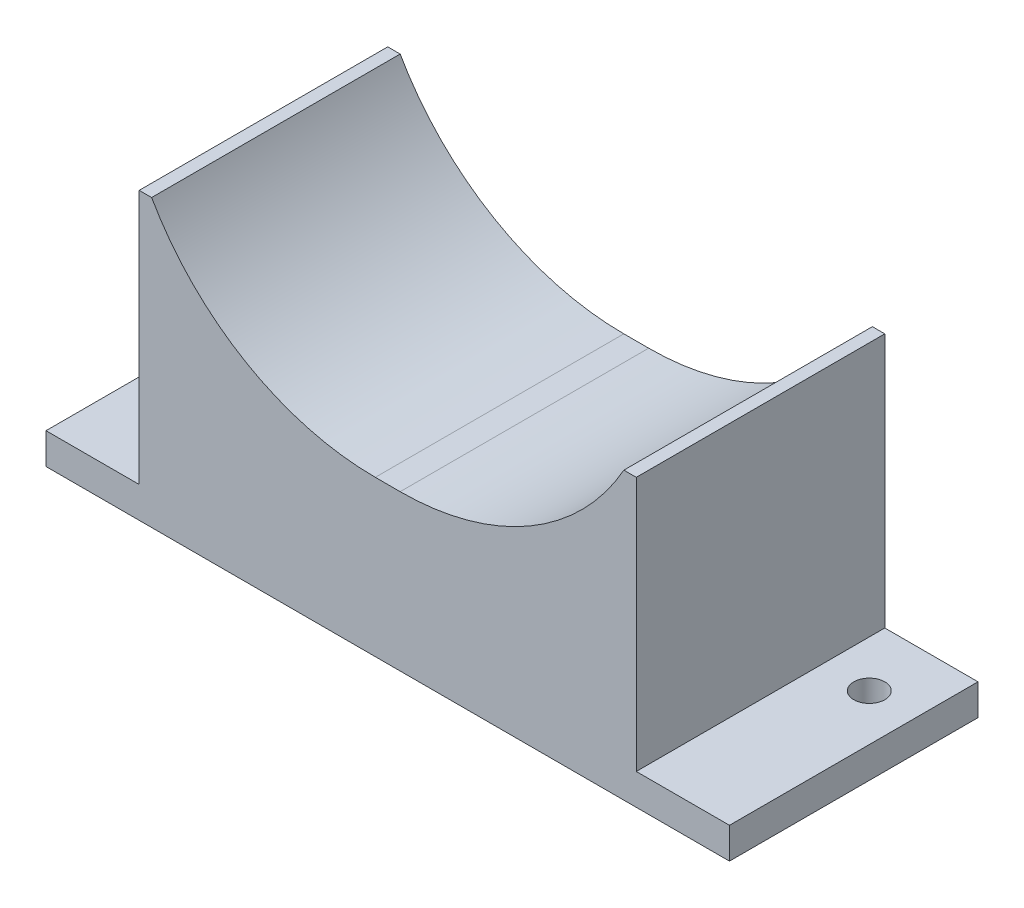
ISO-10303-21;
HEADER;
FILE_DESCRIPTION(('STEP AP214'),'2;1');
FILE_NAME('part.step','',(''),(''),'','','');
FILE_SCHEMA(('AUTOMOTIVE_DESIGN { 1 0 10303 214 1 1 1 1 }'));
ENDSEC;
DATA;
#1=APPLICATION_CONTEXT('core data for automotive mechanical design processes');
#2=APPLICATION_PROTOCOL_DEFINITION('international standard','automotive_design',2000,#1);
#3=PRODUCT_CONTEXT('',#1,'mechanical');
#4=PRODUCT('Part','Part','',(#3));
#5=PRODUCT_RELATED_PRODUCT_CATEGORY('part','',(#4));
#6=PRODUCT_DEFINITION_FORMATION('','',#4);
#7=PRODUCT_DEFINITION_CONTEXT('part definition',#1,'design');
#8=PRODUCT_DEFINITION('design','',#6,#7);
#9=PRODUCT_DEFINITION_SHAPE('','',#8);
#10=(LENGTH_UNIT() NAMED_UNIT(*) SI_UNIT(.MILLI.,.METRE.));
#11=(NAMED_UNIT(*) PLANE_ANGLE_UNIT() SI_UNIT($,.RADIAN.));
#12=(NAMED_UNIT(*) SI_UNIT($,.STERADIAN.) SOLID_ANGLE_UNIT());
#13=UNCERTAINTY_MEASURE_WITH_UNIT(LENGTH_MEASURE(1.E-05),#10,'distance_accuracy_value','');
#14=(GEOMETRIC_REPRESENTATION_CONTEXT(3) GLOBAL_UNCERTAINTY_ASSIGNED_CONTEXT((#13)) GLOBAL_UNIT_ASSIGNED_CONTEXT((#10,
#11,#12)) REPRESENTATION_CONTEXT('',''));
#15=CARTESIAN_POINT('',(0.,0.,0.));
#16=DIRECTION('',(0.,0.,1.));
#17=DIRECTION('',(1.,0.,0.));
#18=AXIS2_PLACEMENT_3D('',#15,#16,#17);
#19=CARTESIAN_POINT('',(-40.,4.99999999999999,40.));
#20=DIRECTION('',(1.,0.,0.));
#21=DIRECTION('',(0.,0.,-1.));
#22=AXIS2_PLACEMENT_3D('',#19,#20,#21);
#23=PLANE('',#22);
#24=DIRECTION('',(0.,-1.,0.));
#25=VECTOR('',#24,1.);
#26=CARTESIAN_POINT('',(-40.,4.99999999999999,0.));
#27=LINE('',#26,#25);
#28=CARTESIAN_POINT('',(-40.,46.,0.));
#29=VERTEX_POINT('',#28);
#30=CARTESIAN_POINT('',(-40.,4.99999999999999,0.));
#31=VERTEX_POINT('',#30);
#32=EDGE_CURVE('E165',#29,#31,#27,.T.);
#33=ORIENTED_EDGE('',*,*,#32,.T.);
#34=DIRECTION('',(0.,0.,-1.));
#35=VECTOR('',#34,1.);
#36=CARTESIAN_POINT('',(-40.,4.99999999999999,40.));
#37=LINE('',#36,#35);
#38=CARTESIAN_POINT('',(-40.,4.99999999999999,40.));
#39=VERTEX_POINT('',#38);
#40=EDGE_CURVE('E11',#39,#31,#37,.T.);
#41=ORIENTED_EDGE('',*,*,#40,.F.);
#42=DIRECTION('',(0.,-1.,0.));
#43=VECTOR('',#42,1.);
#44=CARTESIAN_POINT('',(-40.,4.99999999999999,40.));
#45=LINE('',#44,#43);
#46=CARTESIAN_POINT('',(-40.,46.,40.));
#47=VERTEX_POINT('',#46);
#48=EDGE_CURVE('E199',#47,#39,#45,.T.);
#49=ORIENTED_EDGE('',*,*,#48,.F.);
#50=DIRECTION('',(0.,0.,-1.));
#51=VECTOR('',#50,1.);
#52=CARTESIAN_POINT('',(-40.,46.,40.));
#53=LINE('',#52,#51);
#54=EDGE_CURVE('E161',#47,#29,#53,.T.);
#55=ORIENTED_EDGE('',*,*,#54,.T.);
#56=EDGE_LOOP('',(#33,#41,#49,#55));
#57=FACE_BOUND('',#56,.T.);
#58=ADVANCED_FACE('F39',(#57),#23,.F.);
#59=CARTESIAN_POINT('',(-55.,4.99999999999999,40.));
#60=DIRECTION('',(0.,-1.,0.));
#61=DIRECTION('',(0.,0.,-1.));
#62=AXIS2_PLACEMENT_3D('',#59,#60,#61);
#63=PLANE('',#62);
#64=CARTESIAN_POINT('',(-47.5,4.99999999999997,10.));
#65=DIRECTION('',(0.,1.,0.));
#66=DIRECTION('',(-1.,0.,0.));
#67=AXIS2_PLACEMENT_3D('',#64,#65,#66);
#68=CIRCLE('',#67,2.5);
#69=CARTESIAN_POINT('',(-50.,4.99999999999997,10.));
#70=VERTEX_POINT('',#69);
#71=EDGE_CURVE('E394',#70,#70,#68,.T.);
#72=ORIENTED_EDGE('',*,*,#71,.F.);
#73=EDGE_LOOP('',(#72));
#74=FACE_BOUND('',#73,.T.);
#75=DIRECTION('',(-1.,0.,0.));
#76=VECTOR('',#75,1.);
#77=CARTESIAN_POINT('',(-55.,4.99999999999999,0.));
#78=LINE('',#77,#76);
#79=CARTESIAN_POINT('',(-55.,4.99999999999999,0.));
#80=VERTEX_POINT('',#79);
#81=EDGE_CURVE('E169',#31,#80,#78,.T.);
#82=ORIENTED_EDGE('',*,*,#81,.T.);
#83=DIRECTION('',(0.,0.,-1.));
#84=VECTOR('',#83,1.);
#85=CARTESIAN_POINT('',(-55.,4.99999999999999,40.));
#86=LINE('',#85,#84);
#87=CARTESIAN_POINT('',(-55.,4.99999999999999,40.));
#88=VERTEX_POINT('',#87);
#89=EDGE_CURVE('E49',#88,#80,#86,.T.);
#90=ORIENTED_EDGE('',*,*,#89,.F.);
#91=DIRECTION('',(-1.,0.,0.));
#92=VECTOR('',#91,1.);
#93=CARTESIAN_POINT('',(-55.,4.99999999999999,40.));
#94=LINE('',#93,#92);
#95=EDGE_CURVE('E112',#39,#88,#94,.T.);
#96=ORIENTED_EDGE('',*,*,#95,.F.);
#97=ORIENTED_EDGE('',*,*,#40,.T.);
#98=EDGE_LOOP('',(#82,#90,#96,#97));
#99=FACE_BOUND('',#98,.T.);
#100=ADVANCED_FACE('F294',(#74,#99),#63,.F.);
#101=CARTESIAN_POINT('',(-55.,0.,40.));
#102=DIRECTION('',(1.,0.,0.));
#103=DIRECTION('',(0.,0.,-1.));
#104=AXIS2_PLACEMENT_3D('',#101,#102,#103);
#105=PLANE('',#104);
#106=DIRECTION('',(0.,-1.,0.));
#107=VECTOR('',#106,1.);
#108=CARTESIAN_POINT('',(-55.,0.,0.));
#109=LINE('',#108,#107);
#110=CARTESIAN_POINT('',(-55.,0.,0.));
#111=VERTEX_POINT('',#110);
#112=EDGE_CURVE('E172',#80,#111,#109,.T.);
#113=ORIENTED_EDGE('',*,*,#112,.T.);
#114=DIRECTION('',(0.,0.,-1.));
#115=VECTOR('',#114,1.);
#116=CARTESIAN_POINT('',(-55.,0.,40.));
#117=LINE('',#116,#115);
#118=CARTESIAN_POINT('',(-55.,0.,40.));
#119=VERTEX_POINT('',#118);
#120=EDGE_CURVE('E226',#119,#111,#117,.T.);
#121=ORIENTED_EDGE('',*,*,#120,.F.);
#122=DIRECTION('',(0.,-1.,0.));
#123=VECTOR('',#122,1.);
#124=CARTESIAN_POINT('',(-55.,0.,40.));
#125=LINE('',#124,#123);
#126=EDGE_CURVE('E237',#88,#119,#125,.T.);
#127=ORIENTED_EDGE('',*,*,#126,.F.);
#128=ORIENTED_EDGE('',*,*,#89,.T.);
#129=EDGE_LOOP('',(#113,#121,#127,#128));
#130=FACE_BOUND('',#129,.T.);
#131=ADVANCED_FACE('F235',(#130),#105,.F.);
#132=CARTESIAN_POINT('',(55.,0.,40.));
#133=DIRECTION('',(0.,1.,0.));
#134=DIRECTION('',(-1.,0.,0.));
#135=AXIS2_PLACEMENT_3D('',#132,#133,#134);
#136=PLANE('',#135);
#137=CARTESIAN_POINT('',(-47.5,0.,10.));
#138=DIRECTION('',(0.,1.,0.));
#139=DIRECTION('',(-1.,0.,0.));
#140=AXIS2_PLACEMENT_3D('',#137,#138,#139);
#141=CIRCLE('',#140,2.5);
#142=CARTESIAN_POINT('',(-50.,0.,10.));
#143=VERTEX_POINT('',#142);
#144=EDGE_CURVE('E42',#143,#143,#141,.T.);
#145=ORIENTED_EDGE('',*,*,#144,.T.);
#146=EDGE_LOOP('',(#145));
#147=FACE_BOUND('',#146,.T.);
#148=CARTESIAN_POINT('',(47.5,0.,9.99999999999999));
#149=DIRECTION('',(0.,1.,0.));
#150=DIRECTION('',(-1.,0.,0.));
#151=AXIS2_PLACEMENT_3D('',#148,#149,#150);
#152=CIRCLE('',#151,2.5);
#153=CARTESIAN_POINT('',(45.,0.,9.99999999999999));
#154=VERTEX_POINT('',#153);
#155=EDGE_CURVE('E398',#154,#154,#152,.T.);
#156=ORIENTED_EDGE('',*,*,#155,.T.);
#157=EDGE_LOOP('',(#156));
#158=FACE_BOUND('',#157,.T.);
#159=DIRECTION('',(1.,0.,0.));
#160=VECTOR('',#159,1.);
#161=CARTESIAN_POINT('',(55.,0.,0.));
#162=LINE('',#161,#160);
#163=CARTESIAN_POINT('',(55.,0.,0.));
#164=VERTEX_POINT('',#163);
#165=EDGE_CURVE('E175',#111,#164,#162,.T.);
#166=ORIENTED_EDGE('',*,*,#165,.T.);
#167=DIRECTION('',(0.,0.,-1.));
#168=VECTOR('',#167,1.);
#169=CARTESIAN_POINT('',(55.,0.,40.));
#170=LINE('',#169,#168);
#171=CARTESIAN_POINT('',(55.,0.,40.));
#172=VERTEX_POINT('',#171);
#173=EDGE_CURVE('E222',#172,#164,#170,.T.);
#174=ORIENTED_EDGE('',*,*,#173,.F.);
#175=DIRECTION('',(1.,0.,0.));
#176=VECTOR('',#175,1.);
#177=CARTESIAN_POINT('',(55.,0.,40.));
#178=LINE('',#177,#176);
#179=EDGE_CURVE('E256',#119,#172,#178,.T.);
#180=ORIENTED_EDGE('',*,*,#179,.F.);
#181=ORIENTED_EDGE('',*,*,#120,.T.);
#182=EDGE_LOOP('',(#166,#174,#180,#181));
#183=FACE_BOUND('',#182,.T.);
#184=ADVANCED_FACE('F246',(#147,#158,#183),#136,.F.);
#185=CARTESIAN_POINT('',(55.,0.,40.));
#186=DIRECTION('',(-1.,0.,0.));
#187=DIRECTION('',(0.,0.,1.));
#188=AXIS2_PLACEMENT_3D('',#185,#186,#187);
#189=PLANE('',#188);
#190=DIRECTION('',(0.,1.,0.));
#191=VECTOR('',#190,1.);
#192=CARTESIAN_POINT('',(55.,0.,0.));
#193=LINE('',#192,#191);
#194=CARTESIAN_POINT('',(55.,5.,0.));
#195=VERTEX_POINT('',#194);
#196=EDGE_CURVE('E178',#164,#195,#193,.T.);
#197=ORIENTED_EDGE('',*,*,#196,.T.);
#198=DIRECTION('',(0.,0.,-1.));
#199=VECTOR('',#198,1.);
#200=CARTESIAN_POINT('',(55.,5.,40.));
#201=LINE('',#200,#199);
#202=CARTESIAN_POINT('',(55.,5.,40.));
#203=VERTEX_POINT('',#202);
#204=EDGE_CURVE('E218',#203,#195,#201,.T.);
#205=ORIENTED_EDGE('',*,*,#204,.F.);
#206=DIRECTION('',(0.,1.,0.));
#207=VECTOR('',#206,1.);
#208=CARTESIAN_POINT('',(55.,0.,40.));
#209=LINE('',#208,#207);
#210=EDGE_CURVE('E252',#172,#203,#209,.T.);
#211=ORIENTED_EDGE('',*,*,#210,.F.);
#212=ORIENTED_EDGE('',*,*,#173,.T.);
#213=EDGE_LOOP('',(#197,#205,#211,#212));
#214=FACE_BOUND('',#213,.T.);
#215=ADVANCED_FACE('F250',(#214),#189,.F.);
#216=CARTESIAN_POINT('',(55.,5.,40.));
#217=DIRECTION('',(0.,-1.,0.));
#218=DIRECTION('',(1.,0.,0.));
#219=AXIS2_PLACEMENT_3D('',#216,#217,#218);
#220=PLANE('',#219);
#221=CARTESIAN_POINT('',(47.5,5.,9.99999999999999));
#222=DIRECTION('',(0.,1.,0.));
#223=DIRECTION('',(1.,0.,0.));
#224=AXIS2_PLACEMENT_3D('',#221,#222,#223);
#225=CIRCLE('',#224,2.5);
#226=CARTESIAN_POINT('',(50.,5.,9.99999999999999));
#227=VERTEX_POINT('',#226);
#228=EDGE_CURVE('E405',#227,#227,#225,.T.);
#229=ORIENTED_EDGE('',*,*,#228,.F.);
#230=EDGE_LOOP('',(#229));
#231=FACE_BOUND('',#230,.T.);
#232=DIRECTION('',(-1.,0.,0.));
#233=VECTOR('',#232,1.);
#234=CARTESIAN_POINT('',(55.,5.,0.));
#235=LINE('',#234,#233);
#236=CARTESIAN_POINT('',(40.,5.,0.));
#237=VERTEX_POINT('',#236);
#238=EDGE_CURVE('E181',#195,#237,#235,.T.);
#239=ORIENTED_EDGE('',*,*,#238,.T.);
#240=DIRECTION('',(0.,0.,-1.));
#241=VECTOR('',#240,1.);
#242=CARTESIAN_POINT('',(40.,5.,40.));
#243=LINE('',#242,#241);
#244=CARTESIAN_POINT('',(40.,5.,40.));
#245=VERTEX_POINT('',#244);
#246=EDGE_CURVE('E214',#245,#237,#243,.T.);
#247=ORIENTED_EDGE('',*,*,#246,.F.);
#248=DIRECTION('',(-1.,0.,0.));
#249=VECTOR('',#248,1.);
#250=CARTESIAN_POINT('',(55.,5.,40.));
#251=LINE('',#250,#249);
#252=EDGE_CURVE('E255',#203,#245,#251,.T.);
#253=ORIENTED_EDGE('',*,*,#252,.F.);
#254=ORIENTED_EDGE('',*,*,#204,.T.);
#255=EDGE_LOOP('',(#239,#247,#253,#254));
#256=FACE_BOUND('',#255,.T.);
#257=ADVANCED_FACE('F310',(#231,#256),#220,.F.);
#258=CARTESIAN_POINT('',(40.,5.,40.));
#259=DIRECTION('',(-1.,0.,0.));
#260=DIRECTION('',(0.,-1.,0.));
#261=AXIS2_PLACEMENT_3D('',#258,#259,#260);
#262=PLANE('',#261);
#263=DIRECTION('',(0.,1.,0.));
#264=VECTOR('',#263,1.);
#265=CARTESIAN_POINT('',(40.,5.,0.));
#266=LINE('',#265,#264);
#267=CARTESIAN_POINT('',(40.,46.,0.));
#268=VERTEX_POINT('',#267);
#269=EDGE_CURVE('E184',#237,#268,#266,.T.);
#270=ORIENTED_EDGE('',*,*,#269,.T.);
#271=DIRECTION('',(0.,0.,-1.));
#272=VECTOR('',#271,1.);
#273=CARTESIAN_POINT('',(40.,46.,40.));
#274=LINE('',#273,#272);
#275=CARTESIAN_POINT('',(40.,46.,40.));
#276=VERTEX_POINT('',#275);
#277=EDGE_CURVE('E210',#276,#268,#274,.T.);
#278=ORIENTED_EDGE('',*,*,#277,.F.);
#279=DIRECTION('',(0.,1.,0.));
#280=VECTOR('',#279,1.);
#281=CARTESIAN_POINT('',(40.,5.,40.));
#282=LINE('',#281,#280);
#283=EDGE_CURVE('E260',#245,#276,#282,.T.);
#284=ORIENTED_EDGE('',*,*,#283,.F.);
#285=ORIENTED_EDGE('',*,*,#246,.T.);
#286=EDGE_LOOP('',(#270,#278,#284,#285));
#287=FACE_BOUND('',#286,.T.);
#288=ADVANCED_FACE('F313',(#287),#262,.F.);
#289=CARTESIAN_POINT('',(40.,46.,40.));
#290=DIRECTION('',(0.,-1.,0.));
#291=DIRECTION('',(1.,0.,0.));
#292=AXIS2_PLACEMENT_3D('',#289,#290,#291);
#293=PLANE('',#292);
#294=DIRECTION('',(-1.,0.,0.));
#295=VECTOR('',#294,1.);
#296=CARTESIAN_POINT('',(40.,46.,0.));
#297=LINE('',#296,#295);
#298=CARTESIAN_POINT('',(38.,46.,0.));
#299=VERTEX_POINT('',#298);
#300=EDGE_CURVE('E187',#268,#299,#297,.T.);
#301=ORIENTED_EDGE('',*,*,#300,.T.);
#302=DIRECTION('',(0.,0.,-1.));
#303=VECTOR('',#302,1.);
#304=CARTESIAN_POINT('',(38.,46.,40.));
#305=LINE('',#304,#303);
#306=CARTESIAN_POINT('',(38.,46.,40.));
#307=VERTEX_POINT('',#306);
#308=EDGE_CURVE('E206',#307,#299,#305,.T.);
#309=ORIENTED_EDGE('',*,*,#308,.F.);
#310=DIRECTION('',(-1.,0.,0.));
#311=VECTOR('',#310,1.);
#312=CARTESIAN_POINT('',(40.,46.,40.));
#313=LINE('',#312,#311);
#314=EDGE_CURVE('E267',#276,#307,#313,.T.);
#315=ORIENTED_EDGE('',*,*,#314,.F.);
#316=ORIENTED_EDGE('',*,*,#277,.T.);
#317=EDGE_LOOP('',(#301,#309,#315,#316));
#318=FACE_BOUND('',#317,.T.);
#319=ADVANCED_FACE('F275',(#318),#293,.F.);
#320=CARTESIAN_POINT('',(1.99999999999999,66.3571428571429,40.));
#321=DIRECTION('',(0.,0.,-1.));
#322=DIRECTION('',(-1.,0.,0.));
#323=AXIS2_PLACEMENT_3D('',#320,#321,#322);
#324=CYLINDRICAL_SURFACE('',#323,41.3571428571429);
#325=CARTESIAN_POINT('',(1.99999999999999,66.3571428571429,0.));
#326=DIRECTION('',(0.,0.,-1.));
#327=DIRECTION('',(1.,0.,0.));
#328=AXIS2_PLACEMENT_3D('',#325,#326,#327);
#329=CIRCLE('',#328,41.3571428571429);
#330=CARTESIAN_POINT('',(1.99999999999998,25.,0.));
#331=VERTEX_POINT('',#330);
#332=EDGE_CURVE('E190',#299,#331,#329,.T.);
#333=ORIENTED_EDGE('',*,*,#332,.T.);
#334=DIRECTION('',(0.,0.,-1.));
#335=VECTOR('',#334,1.);
#336=CARTESIAN_POINT('',(1.99999999999998,25.,40.));
#337=LINE('',#336,#335);
#338=CARTESIAN_POINT('',(1.99999999999998,25.,40.));
#339=VERTEX_POINT('',#338);
#340=EDGE_CURVE('E154',#339,#331,#337,.T.);
#341=ORIENTED_EDGE('',*,*,#340,.F.);
#342=CARTESIAN_POINT('',(1.99999999999999,66.3571428571429,40.));
#343=DIRECTION('',(0.,0.,-1.));
#344=DIRECTION('',(1.,0.,0.));
#345=AXIS2_PLACEMENT_3D('',#342,#343,#344);
#346=CIRCLE('',#345,41.3571428571429);
#347=EDGE_CURVE('E143',#307,#339,#346,.T.);
#348=ORIENTED_EDGE('',*,*,#347,.F.);
#349=ORIENTED_EDGE('',*,*,#308,.T.);
#350=EDGE_LOOP('',(#333,#341,#348,#349));
#351=FACE_BOUND('',#350,.T.);
#352=ADVANCED_FACE('F279',(#351),#324,.F.);
#353=CARTESIAN_POINT('',(2.,25.,40.));
#354=DIRECTION('',(0.,-1.,0.));
#355=DIRECTION('',(1.,0.,0.));
#356=AXIS2_PLACEMENT_3D('',#353,#354,#355);
#357=PLANE('',#356);
#358=DIRECTION('',(-1.,0.,0.));
#359=VECTOR('',#358,1.);
#360=CARTESIAN_POINT('',(2.,25.,0.));
#361=LINE('',#360,#359);
#362=CARTESIAN_POINT('',(-2.,25.,0.));
#363=VERTEX_POINT('',#362);
#364=EDGE_CURVE('E152',#331,#363,#361,.T.);
#365=ORIENTED_EDGE('',*,*,#364,.T.);
#366=DIRECTION('',(0.,0.,-1.));
#367=VECTOR('',#366,1.);
#368=CARTESIAN_POINT('',(-2.,25.,40.));
#369=LINE('',#368,#367);
#370=CARTESIAN_POINT('',(-2.,25.,40.));
#371=VERTEX_POINT('',#370);
#372=EDGE_CURVE('E149',#371,#363,#369,.T.);
#373=ORIENTED_EDGE('',*,*,#372,.F.);
#374=DIRECTION('',(-1.,0.,0.));
#375=VECTOR('',#374,1.);
#376=CARTESIAN_POINT('',(2.,25.,40.));
#377=LINE('',#376,#375);
#378=EDGE_CURVE('E137',#339,#371,#377,.T.);
#379=ORIENTED_EDGE('',*,*,#378,.F.);
#380=ORIENTED_EDGE('',*,*,#340,.T.);
#381=EDGE_LOOP('',(#365,#373,#379,#380));
#382=FACE_BOUND('',#381,.T.);
#383=ADVANCED_FACE('F150',(#382),#357,.F.);
#384=CARTESIAN_POINT('',(-2.,66.3571428571429,40.));
#385=DIRECTION('',(0.,0.,-1.));
#386=DIRECTION('',(-1.,0.,0.));
#387=AXIS2_PLACEMENT_3D('',#384,#385,#386);
#388=CYLINDRICAL_SURFACE('',#387,41.3571428571429);
#389=CARTESIAN_POINT('',(-2.,66.3571428571429,0.));
#390=DIRECTION('',(0.,0.,-1.));
#391=DIRECTION('',(-1.,0.,0.));
#392=AXIS2_PLACEMENT_3D('',#389,#390,#391);
#393=CIRCLE('',#392,41.3571428571429);
#394=CARTESIAN_POINT('',(-38.,46.,0.));
#395=VERTEX_POINT('',#394);
#396=EDGE_CURVE('E98',#363,#395,#393,.T.);
#397=ORIENTED_EDGE('',*,*,#396,.T.);
#398=DIRECTION('',(0.,0.,-1.));
#399=VECTOR('',#398,1.);
#400=CARTESIAN_POINT('',(-38.,46.,40.));
#401=LINE('',#400,#399);
#402=CARTESIAN_POINT('',(-38.,46.,40.));
#403=VERTEX_POINT('',#402);
#404=EDGE_CURVE('E155',#403,#395,#401,.T.);
#405=ORIENTED_EDGE('',*,*,#404,.F.);
#406=CARTESIAN_POINT('',(-2.,66.3571428571429,40.));
#407=DIRECTION('',(0.,0.,-1.));
#408=DIRECTION('',(-1.,0.,0.));
#409=AXIS2_PLACEMENT_3D('',#406,#407,#408);
#410=CIRCLE('',#409,41.3571428571429);
#411=EDGE_CURVE('E141',#371,#403,#410,.T.);
#412=ORIENTED_EDGE('',*,*,#411,.F.);
#413=ORIENTED_EDGE('',*,*,#372,.T.);
#414=EDGE_LOOP('',(#397,#405,#412,#413));
#415=FACE_BOUND('',#414,.T.);
#416=ADVANCED_FACE('F157',(#415),#388,.F.);
#417=CARTESIAN_POINT('',(-40.,46.,40.));
#418=DIRECTION('',(0.,-1.,0.));
#419=DIRECTION('',(1.,0.,0.));
#420=AXIS2_PLACEMENT_3D('',#417,#418,#419);
#421=PLANE('',#420);
#422=DIRECTION('',(-1.,0.,0.));
#423=VECTOR('',#422,1.);
#424=CARTESIAN_POINT('',(-40.,46.,0.));
#425=LINE('',#424,#423);
#426=EDGE_CURVE('E104',#395,#29,#425,.T.);
#427=ORIENTED_EDGE('',*,*,#426,.T.);
#428=ORIENTED_EDGE('',*,*,#54,.F.);
#429=DIRECTION('',(-1.,0.,0.));
#430=VECTOR('',#429,1.);
#431=CARTESIAN_POINT('',(-40.,46.,40.));
#432=LINE('',#431,#430);
#433=EDGE_CURVE('E57',#403,#47,#432,.T.);
#434=ORIENTED_EDGE('',*,*,#433,.F.);
#435=ORIENTED_EDGE('',*,*,#404,.T.);
#436=EDGE_LOOP('',(#427,#428,#434,#435));
#437=FACE_BOUND('',#436,.T.);
#438=ADVANCED_FACE('F283',(#437),#421,.F.);
#439=CARTESIAN_POINT('',(-2.,66.3571428571429,40.));
#440=DIRECTION('',(0.,0.,-1.));
#441=DIRECTION('',(-1.,0.,0.));
#442=AXIS2_PLACEMENT_3D('',#439,#440,#441);
#443=PLANE('',#442);
#444=ORIENTED_EDGE('',*,*,#48,.T.);
#445=ORIENTED_EDGE('',*,*,#95,.T.);
#446=ORIENTED_EDGE('',*,*,#126,.T.);
#447=ORIENTED_EDGE('',*,*,#179,.T.);
#448=ORIENTED_EDGE('',*,*,#210,.T.);
#449=ORIENTED_EDGE('',*,*,#252,.T.);
#450=ORIENTED_EDGE('',*,*,#283,.T.);
#451=ORIENTED_EDGE('',*,*,#314,.T.);
#452=ORIENTED_EDGE('',*,*,#347,.T.);
#453=ORIENTED_EDGE('',*,*,#378,.T.);
#454=ORIENTED_EDGE('',*,*,#411,.T.);
#455=ORIENTED_EDGE('',*,*,#433,.T.);
#456=EDGE_LOOP('',(#444,#445,#446,#447,#448,#449,#450,#451,#452,#453,#454,#455));
#457=FACE_BOUND('',#456,.T.);
#458=ADVANCED_FACE('F139',(#457),#443,.F.);
#459=CARTESIAN_POINT('',(-2.,66.3571428571429,0.));
#460=DIRECTION('',(0.,0.,-1.));
#461=DIRECTION('',(-1.,0.,0.));
#462=AXIS2_PLACEMENT_3D('',#459,#460,#461);
#463=PLANE('',#462);
#464=ORIENTED_EDGE('',*,*,#32,.F.);
#465=ORIENTED_EDGE('',*,*,#426,.F.);
#466=ORIENTED_EDGE('',*,*,#396,.F.);
#467=ORIENTED_EDGE('',*,*,#364,.F.);
#468=ORIENTED_EDGE('',*,*,#332,.F.);
#469=ORIENTED_EDGE('',*,*,#300,.F.);
#470=ORIENTED_EDGE('',*,*,#269,.F.);
#471=ORIENTED_EDGE('',*,*,#238,.F.);
#472=ORIENTED_EDGE('',*,*,#196,.F.);
#473=ORIENTED_EDGE('',*,*,#165,.F.);
#474=ORIENTED_EDGE('',*,*,#112,.F.);
#475=ORIENTED_EDGE('',*,*,#81,.F.);
#476=EDGE_LOOP('',(#464,#465,#466,#467,#468,#469,#470,#471,#472,#473,#474,#475));
#477=FACE_BOUND('',#476,.T.);
#478=ADVANCED_FACE('F241',(#477),#463,.T.);
#479=CARTESIAN_POINT('',(47.5,-35.,9.99999999999999));
#480=DIRECTION('',(0.,1.,0.));
#481=DIRECTION('',(-1.,0.,0.));
#482=AXIS2_PLACEMENT_3D('',#479,#480,#481);
#483=CYLINDRICAL_SURFACE('',#482,2.5);
#484=ORIENTED_EDGE('',*,*,#228,.T.);
#485=EDGE_LOOP('',(#484));
#486=FACE_BOUND('',#485,.T.);
#487=ORIENTED_EDGE('',*,*,#155,.F.);
#488=EDGE_LOOP('',(#487));
#489=FACE_BOUND('',#488,.T.);
#490=ADVANCED_FACE('F349',(#486,#489),#483,.F.);
#491=CARTESIAN_POINT('',(-47.5,-35.,10.));
#492=DIRECTION('',(0.,1.,0.));
#493=DIRECTION('',(-1.,0.,0.));
#494=AXIS2_PLACEMENT_3D('',#491,#492,#493);
#495=CYLINDRICAL_SURFACE('',#494,2.5);
#496=ORIENTED_EDGE('',*,*,#71,.T.);
#497=EDGE_LOOP('',(#496));
#498=FACE_BOUND('',#497,.T.);
#499=ORIENTED_EDGE('',*,*,#144,.F.);
#500=EDGE_LOOP('',(#499));
#501=FACE_BOUND('',#500,.T.);
#502=ADVANCED_FACE('F378',(#498,#501),#495,.F.);
#503=CLOSED_SHELL('',(#58,#100,#131,#184,#215,#257,#288,#319,#352,#383,#416,#438,#458,#478,#490,#502));
#504=MANIFOLD_SOLID_BREP('B2',#503);
#505=ADVANCED_BREP_SHAPE_REPRESENTATION('',(#18,#504),#14);
#506=SHAPE_DEFINITION_REPRESENTATION(#9,#505);
ENDSEC;
END-ISO-10303-21;
